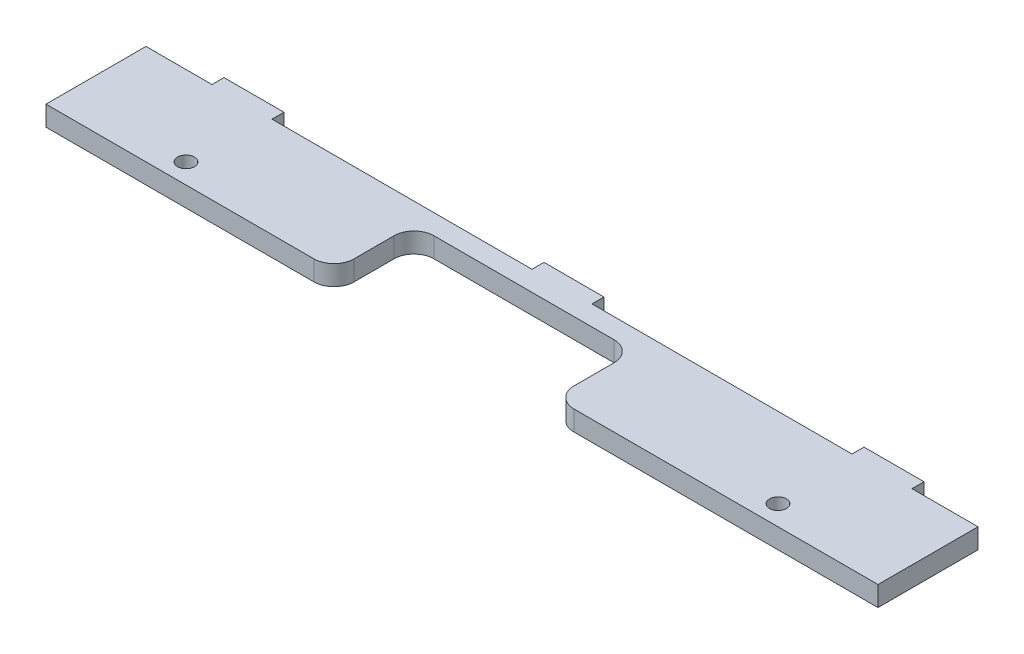
ISO-10303-21;
HEADER;
FILE_DESCRIPTION(('STEP AP214'),'2;1');
FILE_NAME('part.step','',(''),(''),'','','');
FILE_SCHEMA(('AUTOMOTIVE_DESIGN { 1 0 10303 214 1 1 1 1 }'));
ENDSEC;
DATA;
#1=APPLICATION_CONTEXT('core data for automotive mechanical design processes');
#2=APPLICATION_PROTOCOL_DEFINITION('international standard','automotive_design',2000,#1);
#3=PRODUCT_CONTEXT('',#1,'mechanical');
#4=PRODUCT('Part','Part','',(#3));
#5=PRODUCT_RELATED_PRODUCT_CATEGORY('part','',(#4));
#6=PRODUCT_DEFINITION_FORMATION('','',#4);
#7=PRODUCT_DEFINITION_CONTEXT('part definition',#1,'design');
#8=PRODUCT_DEFINITION('design','',#6,#7);
#9=PRODUCT_DEFINITION_SHAPE('','',#8);
#10=(LENGTH_UNIT() NAMED_UNIT(*) SI_UNIT(.MILLI.,.METRE.));
#11=(NAMED_UNIT(*) PLANE_ANGLE_UNIT() SI_UNIT($,.RADIAN.));
#12=(NAMED_UNIT(*) SI_UNIT($,.STERADIAN.) SOLID_ANGLE_UNIT());
#13=UNCERTAINTY_MEASURE_WITH_UNIT(LENGTH_MEASURE(1.E-05),#10,'distance_accuracy_value','');
#14=(GEOMETRIC_REPRESENTATION_CONTEXT(3) GLOBAL_UNCERTAINTY_ASSIGNED_CONTEXT((#13)) GLOBAL_UNIT_ASSIGNED_CONTEXT((#10,
#11,#12)) REPRESENTATION_CONTEXT('',''));
#15=CARTESIAN_POINT('',(0.,0.,0.));
#16=DIRECTION('',(0.,0.,1.));
#17=DIRECTION('',(1.,0.,0.));
#18=AXIS2_PLACEMENT_3D('',#15,#16,#17);
#19=CARTESIAN_POINT('',(-59.7452991513512,5.,-16.6679805469306));
#20=DIRECTION('',(0.,0.,1.));
#21=DIRECTION('',(1.,0.,0.));
#22=AXIS2_PLACEMENT_3D('',#19,#20,#21);
#23=PLANE('',#22);
#24=DIRECTION('',(-1.,0.,0.));
#25=VECTOR('',#24,1.);
#26=CARTESIAN_POINT('',(-59.7452991513512,0.,-16.6679805469306));
#27=LINE('',#26,#25);
#28=CARTESIAN_POINT('',(36.7547008486487,0.,-16.6679805469306));
#29=VERTEX_POINT('',#28);
#30=CARTESIAN_POINT('',(-28.2452991513512,0.,-16.6679805469306));
#31=VERTEX_POINT('',#30);
#32=EDGE_CURVE('E308',#29,#31,#27,.T.);
#33=ORIENTED_EDGE('',*,*,#32,.T.);
#34=DIRECTION('',(0.,-1.,0.));
#35=VECTOR('',#34,1.);
#36=CARTESIAN_POINT('',(-28.2452991513512,5.,-16.6679805469312));
#37=LINE('',#36,#35);
#38=CARTESIAN_POINT('',(-28.2452991513512,5.,-16.6679805469306));
#39=VERTEX_POINT('',#38);
#40=EDGE_CURVE('E60',#39,#31,#37,.T.);
#41=ORIENTED_EDGE('',*,*,#40,.F.);
#42=DIRECTION('',(-1.,0.,0.));
#43=VECTOR('',#42,1.);
#44=CARTESIAN_POINT('',(-59.7452991513512,5.,-16.6679805469306));
#45=LINE('',#44,#43);
#46=CARTESIAN_POINT('',(36.7547008486488,5.,-16.6679805469306));
#47=VERTEX_POINT('',#46);
#48=EDGE_CURVE('E340',#47,#39,#45,.T.);
#49=ORIENTED_EDGE('',*,*,#48,.F.);
#50=DIRECTION('',(0.,-1.,0.));
#51=VECTOR('',#50,1.);
#52=CARTESIAN_POINT('',(36.7547008486488,5.,-16.6679805469306));
#53=LINE('',#52,#51);
#54=EDGE_CURVE('E279',#47,#29,#53,.T.);
#55=ORIENTED_EDGE('',*,*,#54,.T.);
#56=EDGE_LOOP('',(#33,#41,#49,#55));
#57=FACE_BOUND('',#56,.T.);
#58=ADVANCED_FACE('F35',(#57),#23,.F.);
#59=CARTESIAN_POINT('',(148.254700848649,0.,-16.6679805469306));
#60=VERTEX_POINT('',#59);
#61=CARTESIAN_POINT('',(131.754700848649,0.,-16.6679805469306));
#62=VERTEX_POINT('',#61);
#63=EDGE_CURVE('E307',#60,#62,#27,.T.);
#64=ORIENTED_EDGE('',*,*,#63,.T.);
#65=DIRECTION('',(0.,-1.,0.));
#66=VECTOR('',#65,1.);
#67=CARTESIAN_POINT('',(131.754700848649,5.,-16.6679805469306));
#68=LINE('',#67,#66);
#69=CARTESIAN_POINT('',(131.754700848649,5.,-16.6679805469306));
#70=VERTEX_POINT('',#69);
#71=EDGE_CURVE('E246',#70,#62,#68,.T.);
#72=ORIENTED_EDGE('',*,*,#71,.F.);
#73=CARTESIAN_POINT('',(148.254700848649,5.,-16.6679805469306));
#74=VERTEX_POINT('',#73);
#75=EDGE_CURVE('E333',#74,#70,#45,.T.);
#76=ORIENTED_EDGE('',*,*,#75,.F.);
#77=DIRECTION('',(0.,-1.,0.));
#78=VECTOR('',#77,1.);
#79=CARTESIAN_POINT('',(148.254700848649,5.,-16.6679805469306));
#80=LINE('',#79,#78);
#81=EDGE_CURVE('E326',#74,#60,#80,.T.);
#82=ORIENTED_EDGE('',*,*,#81,.T.);
#83=EDGE_LOOP('',(#64,#72,#76,#82));
#84=FACE_BOUND('',#83,.T.);
#85=ADVANCED_FACE('F374',(#84),#23,.F.);
#86=CARTESIAN_POINT('',(116.754700848649,5.,-16.6679805469306));
#87=VERTEX_POINT('',#86);
#88=CARTESIAN_POINT('',(51.7547008486488,5.,-16.6679805469306));
#89=VERTEX_POINT('',#88);
#90=EDGE_CURVE('E309',#87,#89,#45,.T.);
#91=ORIENTED_EDGE('',*,*,#90,.F.);
#92=DIRECTION('',(0.,-1.,0.));
#93=VECTOR('',#92,1.);
#94=CARTESIAN_POINT('',(116.754700848649,5.,-16.6679805469306));
#95=LINE('',#94,#93);
#96=CARTESIAN_POINT('',(116.754700848649,0.,-16.6679805469306));
#97=VERTEX_POINT('',#96);
#98=EDGE_CURVE('E259',#87,#97,#95,.T.);
#99=ORIENTED_EDGE('',*,*,#98,.T.);
#100=CARTESIAN_POINT('',(51.7547008486488,0.,-16.6679805469306));
#101=VERTEX_POINT('',#100);
#102=EDGE_CURVE('E304',#97,#101,#27,.T.);
#103=ORIENTED_EDGE('',*,*,#102,.T.);
#104=DIRECTION('',(0.,-1.,0.));
#105=VECTOR('',#104,1.);
#106=CARTESIAN_POINT('',(51.7547008486488,5.,-16.6679805469306));
#107=LINE('',#106,#105);
#108=EDGE_CURVE('E267',#89,#101,#107,.T.);
#109=ORIENTED_EDGE('',*,*,#108,.F.);
#110=EDGE_LOOP('',(#91,#99,#103,#109));
#111=FACE_BOUND('',#110,.T.);
#112=ADVANCED_FACE('F393',(#111),#23,.F.);
#113=CARTESIAN_POINT('',(-59.7452991513512,5.,8.3320194530694));
#114=DIRECTION('',(0.,0.,-1.));
#115=DIRECTION('',(-1.,0.,0.));
#116=AXIS2_PLACEMENT_3D('',#113,#114,#115);
#117=PLANE('',#116);
#118=DIRECTION('',(0.,-1.,0.));
#119=VECTOR('',#118,1.);
#120=CARTESIAN_POINT('',(72.2547008486488,5.,8.3320194530694));
#121=LINE('',#120,#119);
#122=CARTESIAN_POINT('',(72.2547008486488,5.,8.3320194530694));
#123=VERTEX_POINT('',#122);
#124=CARTESIAN_POINT('',(72.2547008486488,0.,8.3320194530694));
#125=VERTEX_POINT('',#124);
#126=EDGE_CURVE('E365',#123,#125,#121,.T.);
#127=ORIENTED_EDGE('',*,*,#126,.T.);
#128=DIRECTION('',(1.,0.,0.));
#129=VECTOR('',#128,1.);
#130=CARTESIAN_POINT('',(-59.7452991513512,0.,8.3320194530694));
#131=LINE('',#130,#129);
#132=CARTESIAN_POINT('',(148.254700848649,0.,8.3320194530694));
#133=VERTEX_POINT('',#132);
#134=EDGE_CURVE('E351',#125,#133,#131,.T.);
#135=ORIENTED_EDGE('',*,*,#134,.T.);
#136=DIRECTION('',(0.,-1.,0.));
#137=VECTOR('',#136,1.);
#138=CARTESIAN_POINT('',(148.254700848649,5.,8.3320194530694));
#139=LINE('',#138,#137);
#140=CARTESIAN_POINT('',(148.254700848649,5.,8.3320194530694));
#141=VERTEX_POINT('',#140);
#142=EDGE_CURVE('E45',#141,#133,#139,.T.);
#143=ORIENTED_EDGE('',*,*,#142,.F.);
#144=DIRECTION('',(1.,0.,0.));
#145=VECTOR('',#144,1.);
#146=CARTESIAN_POINT('',(-59.7452991513512,5.,8.3320194530694));
#147=LINE('',#146,#145);
#148=EDGE_CURVE('E404',#123,#141,#147,.T.);
#149=ORIENTED_EDGE('',*,*,#148,.F.);
#150=EDGE_LOOP('',(#127,#135,#143,#149));
#151=FACE_BOUND('',#150,.T.);
#152=ADVANCED_FACE('F362',(#151),#117,.F.);
#153=CARTESIAN_POINT('',(-59.7452991513512,5.,-16.6679805469306));
#154=DIRECTION('',(1.,0.,0.));
#155=DIRECTION('',(0.,0.,-1.));
#156=AXIS2_PLACEMENT_3D('',#153,#154,#155);
#157=PLANE('',#156);
#158=DIRECTION('',(0.,0.,1.));
#159=VECTOR('',#158,1.);
#160=CARTESIAN_POINT('',(-59.7452991513512,0.,-16.6679805469306));
#161=LINE('',#160,#159);
#162=CARTESIAN_POINT('',(-59.7452991513512,0.,-16.6679805469306));
#163=VERTEX_POINT('',#162);
#164=CARTESIAN_POINT('',(-59.7452991513512,0.,8.3320194530694));
#165=VERTEX_POINT('',#164);
#166=EDGE_CURVE('E347',#163,#165,#161,.T.);
#167=ORIENTED_EDGE('',*,*,#166,.T.);
#168=DIRECTION('',(0.,-1.,0.));
#169=VECTOR('',#168,1.);
#170=CARTESIAN_POINT('',(-59.7452991513512,5.,8.3320194530694));
#171=LINE('',#170,#169);
#172=CARTESIAN_POINT('',(-59.7452991513512,5.,8.3320194530694));
#173=VERTEX_POINT('',#172);
#174=EDGE_CURVE('E11',#173,#165,#171,.T.);
#175=ORIENTED_EDGE('',*,*,#174,.F.);
#176=DIRECTION('',(0.,0.,1.));
#177=VECTOR('',#176,1.);
#178=CARTESIAN_POINT('',(-59.7452991513512,5.,-16.6679805469306));
#179=LINE('',#178,#177);
#180=CARTESIAN_POINT('',(-59.7452991513512,5.,-16.6679805469306));
#181=VERTEX_POINT('',#180);
#182=EDGE_CURVE('E323',#181,#173,#179,.T.);
#183=ORIENTED_EDGE('',*,*,#182,.F.);
#184=DIRECTION('',(0.,-1.,0.));
#185=VECTOR('',#184,1.);
#186=CARTESIAN_POINT('',(-59.7452991513512,5.,-16.6679805469306));
#187=LINE('',#186,#185);
#188=EDGE_CURVE('E315',#181,#163,#187,.T.);
#189=ORIENTED_EDGE('',*,*,#188,.T.);
#190=EDGE_LOOP('',(#167,#175,#183,#189));
#191=FACE_BOUND('',#190,.T.);
#192=ADVANCED_FACE('F37',(#191),#157,.F.);
#193=CARTESIAN_POINT('',(7.25470084864875,0.,8.3320194530694));
#194=VERTEX_POINT('',#193);
#195=EDGE_CURVE('E353',#165,#194,#131,.T.);
#196=ORIENTED_EDGE('',*,*,#195,.T.);
#197=DIRECTION('',(0.,-1.,0.));
#198=VECTOR('',#197,1.);
#199=CARTESIAN_POINT('',(7.25470084864875,5.,8.3320194530694));
#200=LINE('',#199,#198);
#201=CARTESIAN_POINT('',(7.25470084864875,5.,8.3320194530694));
#202=VERTEX_POINT('',#201);
#203=EDGE_CURVE('E414',#202,#194,#200,.T.);
#204=ORIENTED_EDGE('',*,*,#203,.F.);
#205=EDGE_CURVE('E402',#173,#202,#147,.T.);
#206=ORIENTED_EDGE('',*,*,#205,.F.);
#207=ORIENTED_EDGE('',*,*,#174,.T.);
#208=EDGE_LOOP('',(#196,#204,#206,#207));
#209=FACE_BOUND('',#208,.T.);
#210=ADVANCED_FACE('F512',(#209),#117,.F.);
#211=CARTESIAN_POINT('',(148.254700848649,5.,-16.6679805469306));
#212=DIRECTION('',(-1.,0.,0.));
#213=DIRECTION('',(0.,0.,1.));
#214=AXIS2_PLACEMENT_3D('',#211,#212,#213);
#215=PLANE('',#214);
#216=DIRECTION('',(0.,0.,-1.));
#217=VECTOR('',#216,1.);
#218=CARTESIAN_POINT('',(148.254700848649,0.,-16.6679805469306));
#219=LINE('',#218,#217);
#220=EDGE_CURVE('E313',#133,#60,#219,.T.);
#221=ORIENTED_EDGE('',*,*,#220,.T.);
#222=ORIENTED_EDGE('',*,*,#81,.F.);
#223=DIRECTION('',(0.,0.,-1.));
#224=VECTOR('',#223,1.);
#225=CARTESIAN_POINT('',(148.254700848649,5.,-16.6679805469306));
#226=LINE('',#225,#224);
#227=EDGE_CURVE('E345',#141,#74,#226,.T.);
#228=ORIENTED_EDGE('',*,*,#227,.F.);
#229=ORIENTED_EDGE('',*,*,#142,.T.);
#230=EDGE_LOOP('',(#221,#222,#228,#229));
#231=FACE_BOUND('',#230,.T.);
#232=ADVANCED_FACE('F370',(#231),#215,.F.);
#233=CARTESIAN_POINT('',(-43.2452991513512,5.,-16.6679805469306));
#234=VERTEX_POINT('',#233);
#235=EDGE_CURVE('E39',#234,#181,#45,.T.);
#236=ORIENTED_EDGE('',*,*,#235,.F.);
#237=DIRECTION('',(0.,-1.,0.));
#238=VECTOR('',#237,1.);
#239=CARTESIAN_POINT('',(-43.2452991513512,5.,-16.6679805469312));
#240=LINE('',#239,#238);
#241=CARTESIAN_POINT('',(-43.2452991513512,0.,-16.6679805469312));
#242=VERTEX_POINT('',#241);
#243=EDGE_CURVE('E211',#234,#242,#240,.T.);
#244=ORIENTED_EDGE('',*,*,#243,.T.);
#245=EDGE_CURVE('E357',#242,#163,#27,.T.);
#246=ORIENTED_EDGE('',*,*,#245,.T.);
#247=ORIENTED_EDGE('',*,*,#188,.F.);
#248=EDGE_LOOP('',(#236,#244,#246,#247));
#249=FACE_BOUND('',#248,.T.);
#250=ADVANCED_FACE('F501',(#249),#23,.F.);
#251=CARTESIAN_POINT('',(0.,5.,0.));
#252=DIRECTION('',(0.,1.,0.));
#253=DIRECTION('',(0.,0.,1.));
#254=AXIS2_PLACEMENT_3D('',#251,#252,#253);
#255=PLANE('',#254);
#256=CARTESIAN_POINT('',(118.254700848649,5.,3.3320194530694));
#257=DIRECTION('',(0.,-1.,0.));
#258=DIRECTION('',(0.,0.,-1.));
#259=AXIS2_PLACEMENT_3D('',#256,#257,#258);
#260=CIRCLE('',#259,2.1);
#261=CARTESIAN_POINT('',(118.254700848649,5.,1.2320194530694));
#262=VERTEX_POINT('',#261);
#263=EDGE_CURVE('E465',#262,#262,#260,.T.);
#264=ORIENTED_EDGE('',*,*,#263,.T.);
#265=EDGE_LOOP('',(#264));
#266=FACE_BOUND('',#265,.T.);
#267=CARTESIAN_POINT('',(-29.7452991513512,5.,3.3320194530694));
#268=DIRECTION('',(0.,-1.,0.));
#269=DIRECTION('',(0.,0.,-1.));
#270=AXIS2_PLACEMENT_3D('',#267,#268,#269);
#271=CIRCLE('',#270,2.1);
#272=CARTESIAN_POINT('',(-29.7452991513512,5.,1.2320194530694));
#273=VERTEX_POINT('',#272);
#274=EDGE_CURVE('E443',#273,#273,#271,.T.);
#275=ORIENTED_EDGE('',*,*,#274,.T.);
#276=EDGE_LOOP('',(#275));
#277=FACE_BOUND('',#276,.T.);
#278=CARTESIAN_POINT('',(7.25470084864879,5.,3.3320194530694));
#279=DIRECTION('',(0.,1.,0.));
#280=DIRECTION('',(0.,0.,-1.));
#281=AXIS2_PLACEMENT_3D('',#278,#279,#280);
#282=CIRCLE('',#281,5.);
#283=CARTESIAN_POINT('',(12.2547008486488,5.,3.3320194530694));
#284=VERTEX_POINT('',#283);
#285=EDGE_CURVE('E452',#202,#284,#282,.T.);
#286=ORIENTED_EDGE('',*,*,#285,.T.);
#287=DIRECTION('',(0.,0.,-1.));
#288=VECTOR('',#287,1.);
#289=CARTESIAN_POINT('',(12.2547008486488,5.,3.3320194530694));
#290=LINE('',#289,#288);
#291=CARTESIAN_POINT('',(12.2547008486488,5.,-6.6679805469306));
#292=VERTEX_POINT('',#291);
#293=EDGE_CURVE('E449',#284,#292,#290,.T.);
#294=ORIENTED_EDGE('',*,*,#293,.T.);
#295=CARTESIAN_POINT('',(17.2547008486488,5.,-6.6679805469306));
#296=DIRECTION('',(0.,-1.,0.));
#297=DIRECTION('',(0.,0.,1.));
#298=AXIS2_PLACEMENT_3D('',#295,#296,#297);
#299=CIRCLE('',#298,5.);
#300=CARTESIAN_POINT('',(17.2547008486488,5.,-11.6679805469306));
#301=VERTEX_POINT('',#300);
#302=EDGE_CURVE('E446',#292,#301,#299,.T.);
#303=ORIENTED_EDGE('',*,*,#302,.T.);
#304=DIRECTION('',(1.,0.,0.));
#305=VECTOR('',#304,1.);
#306=CARTESIAN_POINT('',(62.2547008486488,5.,-11.6679805469306));
#307=LINE('',#306,#305);
#308=CARTESIAN_POINT('',(62.2547008486488,5.,-11.6679805469306));
#309=VERTEX_POINT('',#308);
#310=EDGE_CURVE('E411',#301,#309,#307,.T.);
#311=ORIENTED_EDGE('',*,*,#310,.T.);
#312=CARTESIAN_POINT('',(62.2547008486488,5.,-6.6679805469306));
#313=DIRECTION('',(0.,-1.,0.));
#314=DIRECTION('',(0.,0.,1.));
#315=AXIS2_PLACEMENT_3D('',#312,#313,#314);
#316=CIRCLE('',#315,5.);
#317=CARTESIAN_POINT('',(67.2547008486488,5.,-6.6679805469306));
#318=VERTEX_POINT('',#317);
#319=EDGE_CURVE('E426',#309,#318,#316,.T.);
#320=ORIENTED_EDGE('',*,*,#319,.T.);
#321=DIRECTION('',(0.,0.,1.));
#322=VECTOR('',#321,1.);
#323=CARTESIAN_POINT('',(67.2547008486488,5.,3.3320194530694));
#324=LINE('',#323,#322);
#325=CARTESIAN_POINT('',(67.2547008486488,5.,3.3320194530694));
#326=VERTEX_POINT('',#325);
#327=EDGE_CURVE('E457',#318,#326,#324,.T.);
#328=ORIENTED_EDGE('',*,*,#327,.T.);
#329=CARTESIAN_POINT('',(72.2547008486488,5.,3.3320194530694));
#330=DIRECTION('',(0.,1.,0.));
#331=DIRECTION('',(0.,0.,-1.));
#332=AXIS2_PLACEMENT_3D('',#329,#330,#331);
#333=CIRCLE('',#332,5.);
#334=EDGE_CURVE('E454',#326,#123,#333,.T.);
#335=ORIENTED_EDGE('',*,*,#334,.T.);
#336=ORIENTED_EDGE('',*,*,#148,.T.);
#337=ORIENTED_EDGE('',*,*,#227,.T.);
#338=ORIENTED_EDGE('',*,*,#75,.T.);
#339=DIRECTION('',(0.,0.,1.));
#340=VECTOR('',#339,1.);
#341=CARTESIAN_POINT('',(131.754700848649,5.,-16.6679805469306));
#342=LINE('',#341,#340);
#343=CARTESIAN_POINT('',(131.754700848649,5.,-19.6679805469306));
#344=VERTEX_POINT('',#343);
#345=EDGE_CURVE('E236',#344,#70,#342,.T.);
#346=ORIENTED_EDGE('',*,*,#345,.F.);
#347=DIRECTION('',(1.,0.,0.));
#348=VECTOR('',#347,1.);
#349=CARTESIAN_POINT('',(116.754700848649,5.,-19.6679805469306));
#350=LINE('',#349,#348);
#351=CARTESIAN_POINT('',(116.754700848649,5.,-19.6679805469306));
#352=VERTEX_POINT('',#351);
#353=EDGE_CURVE('E243',#352,#344,#350,.T.);
#354=ORIENTED_EDGE('',*,*,#353,.F.);
#355=DIRECTION('',(0.,0.,-1.));
#356=VECTOR('',#355,1.);
#357=CARTESIAN_POINT('',(116.754700848649,5.,-16.6679805469306));
#358=LINE('',#357,#356);
#359=EDGE_CURVE('E239',#87,#352,#358,.T.);
#360=ORIENTED_EDGE('',*,*,#359,.F.);
#361=ORIENTED_EDGE('',*,*,#90,.T.);
#362=DIRECTION('',(0.,0.,1.));
#363=VECTOR('',#362,1.);
#364=CARTESIAN_POINT('',(51.7547008486488,5.,-16.6679805469306));
#365=LINE('',#364,#363);
#366=CARTESIAN_POINT('',(51.7547008486488,5.,-19.6679805469306));
#367=VERTEX_POINT('',#366);
#368=EDGE_CURVE('E272',#367,#89,#365,.T.);
#369=ORIENTED_EDGE('',*,*,#368,.F.);
#370=DIRECTION('',(1.,0.,0.));
#371=VECTOR('',#370,1.);
#372=CARTESIAN_POINT('',(36.7547008486488,5.,-19.6679805469306));
#373=LINE('',#372,#371);
#374=CARTESIAN_POINT('',(36.7547008486488,5.,-19.6679805469306));
#375=VERTEX_POINT('',#374);
#376=EDGE_CURVE('E264',#375,#367,#373,.T.);
#377=ORIENTED_EDGE('',*,*,#376,.F.);
#378=DIRECTION('',(0.,0.,-1.));
#379=VECTOR('',#378,1.);
#380=CARTESIAN_POINT('',(36.7547008486488,5.,-16.6679805469306));
#381=LINE('',#380,#379);
#382=EDGE_CURVE('E268',#47,#375,#381,.T.);
#383=ORIENTED_EDGE('',*,*,#382,.F.);
#384=ORIENTED_EDGE('',*,*,#48,.T.);
#385=DIRECTION('',(0.,0.,1.));
#386=VECTOR('',#385,1.);
#387=CARTESIAN_POINT('',(-28.2452991513512,5.,-16.6679805469312));
#388=LINE('',#387,#386);
#389=CARTESIAN_POINT('',(-28.2452991513512,5.,-19.6679805469312));
#390=VERTEX_POINT('',#389);
#391=EDGE_CURVE('E217',#390,#39,#388,.T.);
#392=ORIENTED_EDGE('',*,*,#391,.F.);
#393=DIRECTION('',(1.,0.,0.));
#394=VECTOR('',#393,1.);
#395=CARTESIAN_POINT('',(-43.2452991513512,5.,-19.6679805469312));
#396=LINE('',#395,#394);
#397=CARTESIAN_POINT('',(-43.2452991513512,5.,-19.6679805469312));
#398=VERTEX_POINT('',#397);
#399=EDGE_CURVE('E204',#398,#390,#396,.T.);
#400=ORIENTED_EDGE('',*,*,#399,.F.);
#401=DIRECTION('',(0.,0.,-1.));
#402=VECTOR('',#401,1.);
#403=CARTESIAN_POINT('',(-43.2452991513512,5.,-16.6679805469312));
#404=LINE('',#403,#402);
#405=EDGE_CURVE('E214',#234,#398,#404,.T.);
#406=ORIENTED_EDGE('',*,*,#405,.F.);
#407=ORIENTED_EDGE('',*,*,#235,.T.);
#408=ORIENTED_EDGE('',*,*,#182,.T.);
#409=ORIENTED_EDGE('',*,*,#205,.T.);
#410=EDGE_LOOP('',(#286,#294,#303,#311,#320,#328,#335,#336,#337,#338,#346,#354,#360,#361,#369,
#377,#383,#384,#392,#400,#406,#407,#408,#409));
#411=FACE_BOUND('',#410,.T.);
#412=ADVANCED_FACE('F221',(#266,#277,#411),#255,.T.);
#413=CARTESIAN_POINT('',(0.,0.,0.));
#414=DIRECTION('',(0.,1.,0.));
#415=DIRECTION('',(0.,0.,1.));
#416=AXIS2_PLACEMENT_3D('',#413,#414,#415);
#417=PLANE('',#416);
#418=CARTESIAN_POINT('',(118.254700848649,0.,3.3320194530694));
#419=DIRECTION('',(0.,-1.,0.));
#420=DIRECTION('',(0.,0.,-1.));
#421=AXIS2_PLACEMENT_3D('',#418,#419,#420);
#422=CIRCLE('',#421,2.1);
#423=CARTESIAN_POINT('',(118.254700848649,0.,1.2320194530694));
#424=VERTEX_POINT('',#423);
#425=EDGE_CURVE('E276',#424,#424,#422,.T.);
#426=ORIENTED_EDGE('',*,*,#425,.F.);
#427=EDGE_LOOP('',(#426));
#428=FACE_BOUND('',#427,.T.);
#429=CARTESIAN_POINT('',(-29.7452991513512,0.,3.3320194530694));
#430=DIRECTION('',(0.,-1.,0.));
#431=DIRECTION('',(0.,0.,-1.));
#432=AXIS2_PLACEMENT_3D('',#429,#430,#431);
#433=CIRCLE('',#432,2.1);
#434=CARTESIAN_POINT('',(-29.7452991513512,0.,1.2320194530694));
#435=VERTEX_POINT('',#434);
#436=EDGE_CURVE('E462',#435,#435,#433,.T.);
#437=ORIENTED_EDGE('',*,*,#436,.F.);
#438=EDGE_LOOP('',(#437));
#439=FACE_BOUND('',#438,.T.);
#440=DIRECTION('',(0.,0.,-1.));
#441=VECTOR('',#440,1.);
#442=CARTESIAN_POINT('',(12.2547008486488,0.,3.3320194530694));
#443=LINE('',#442,#441);
#444=CARTESIAN_POINT('',(12.2547008486488,0.,3.3320194530694));
#445=VERTEX_POINT('',#444);
#446=CARTESIAN_POINT('',(12.2547008486488,0.,-6.6679805469306));
#447=VERTEX_POINT('',#446);
#448=EDGE_CURVE('E430',#445,#447,#443,.T.);
#449=ORIENTED_EDGE('',*,*,#448,.F.);
#450=CARTESIAN_POINT('',(7.25470084864879,0.,3.3320194530694));
#451=DIRECTION('',(0.,1.,0.));
#452=DIRECTION('',(0.,0.,-1.));
#453=AXIS2_PLACEMENT_3D('',#450,#451,#452);
#454=CIRCLE('',#453,5.);
#455=EDGE_CURVE('E433',#194,#445,#454,.T.);
#456=ORIENTED_EDGE('',*,*,#455,.F.);
#457=ORIENTED_EDGE('',*,*,#195,.F.);
#458=ORIENTED_EDGE('',*,*,#166,.F.);
#459=ORIENTED_EDGE('',*,*,#245,.F.);
#460=DIRECTION('',(0.,0.,-1.));
#461=VECTOR('',#460,1.);
#462=CARTESIAN_POINT('',(-43.2452991513512,0.,-16.6679805469312));
#463=LINE('',#462,#461);
#464=CARTESIAN_POINT('',(-43.2452991513512,0.,-19.6679805469312));
#465=VERTEX_POINT('',#464);
#466=EDGE_CURVE('E230',#242,#465,#463,.T.);
#467=ORIENTED_EDGE('',*,*,#466,.T.);
#468=DIRECTION('',(1.,0.,0.));
#469=VECTOR('',#468,1.);
#470=CARTESIAN_POINT('',(-43.2452991513512,0.,-19.6679805469312));
#471=LINE('',#470,#469);
#472=CARTESIAN_POINT('',(-28.2452991513512,0.,-19.6679805469312));
#473=VERTEX_POINT('',#472);
#474=EDGE_CURVE('E206',#465,#473,#471,.T.);
#475=ORIENTED_EDGE('',*,*,#474,.T.);
#476=DIRECTION('',(0.,0.,1.));
#477=VECTOR('',#476,1.);
#478=CARTESIAN_POINT('',(-28.2452991513512,0.,-16.6679805469312));
#479=LINE('',#478,#477);
#480=EDGE_CURVE('E227',#473,#31,#479,.T.);
#481=ORIENTED_EDGE('',*,*,#480,.T.);
#482=ORIENTED_EDGE('',*,*,#32,.F.);
#483=DIRECTION('',(0.,0.,-1.));
#484=VECTOR('',#483,1.);
#485=CARTESIAN_POINT('',(36.7547008486488,0.,-16.6679805469306));
#486=LINE('',#485,#484);
#487=CARTESIAN_POINT('',(36.7547008486488,0.,-19.6679805469306));
#488=VERTEX_POINT('',#487);
#489=EDGE_CURVE('E273',#29,#488,#486,.T.);
#490=ORIENTED_EDGE('',*,*,#489,.T.);
#491=DIRECTION('',(1.,0.,0.));
#492=VECTOR('',#491,1.);
#493=CARTESIAN_POINT('',(36.7547008486488,0.,-19.6679805469306));
#494=LINE('',#493,#492);
#495=CARTESIAN_POINT('',(51.7547008486488,0.,-19.6679805469306));
#496=VERTEX_POINT('',#495);
#497=EDGE_CURVE('E269',#488,#496,#494,.T.);
#498=ORIENTED_EDGE('',*,*,#497,.T.);
#499=DIRECTION('',(0.,0.,1.));
#500=VECTOR('',#499,1.);
#501=CARTESIAN_POINT('',(51.7547008486488,0.,-16.6679805469306));
#502=LINE('',#501,#500);
#503=EDGE_CURVE('E256',#496,#101,#502,.T.);
#504=ORIENTED_EDGE('',*,*,#503,.T.);
#505=ORIENTED_EDGE('',*,*,#102,.F.);
#506=DIRECTION('',(0.,0.,-1.));
#507=VECTOR('',#506,1.);
#508=CARTESIAN_POINT('',(116.754700848649,0.,-16.6679805469306));
#509=LINE('',#508,#507);
#510=CARTESIAN_POINT('',(116.754700848649,0.,-19.6679805469306));
#511=VERTEX_POINT('',#510);
#512=EDGE_CURVE('E249',#97,#511,#509,.T.);
#513=ORIENTED_EDGE('',*,*,#512,.T.);
#514=DIRECTION('',(1.,0.,0.));
#515=VECTOR('',#514,1.);
#516=CARTESIAN_POINT('',(116.754700848649,0.,-19.6679805469306));
#517=LINE('',#516,#515);
#518=CARTESIAN_POINT('',(131.754700848649,0.,-19.6679805469306));
#519=VERTEX_POINT('',#518);
#520=EDGE_CURVE('E240',#511,#519,#517,.T.);
#521=ORIENTED_EDGE('',*,*,#520,.T.);
#522=DIRECTION('',(0.,0.,1.));
#523=VECTOR('',#522,1.);
#524=CARTESIAN_POINT('',(131.754700848649,0.,-16.6679805469306));
#525=LINE('',#524,#523);
#526=EDGE_CURVE('E233',#519,#62,#525,.T.);
#527=ORIENTED_EDGE('',*,*,#526,.T.);
#528=ORIENTED_EDGE('',*,*,#63,.F.);
#529=ORIENTED_EDGE('',*,*,#220,.F.);
#530=ORIENTED_EDGE('',*,*,#134,.F.);
#531=CARTESIAN_POINT('',(72.2547008486488,0.,3.3320194530694));
#532=DIRECTION('',(0.,1.,0.));
#533=DIRECTION('',(0.,0.,-1.));
#534=AXIS2_PLACEMENT_3D('',#531,#532,#533);
#535=CIRCLE('',#534,5.);
#536=CARTESIAN_POINT('',(67.2547008486488,0.,3.3320194530694));
#537=VERTEX_POINT('',#536);
#538=EDGE_CURVE('E436',#537,#125,#535,.T.);
#539=ORIENTED_EDGE('',*,*,#538,.F.);
#540=DIRECTION('',(0.,0.,1.));
#541=VECTOR('',#540,1.);
#542=CARTESIAN_POINT('',(67.2547008486488,0.,3.3320194530694));
#543=LINE('',#542,#541);
#544=CARTESIAN_POINT('',(67.2547008486488,0.,-6.6679805469306));
#545=VERTEX_POINT('',#544);
#546=EDGE_CURVE('E438',#545,#537,#543,.T.);
#547=ORIENTED_EDGE('',*,*,#546,.F.);
#548=CARTESIAN_POINT('',(62.2547008486488,0.,-6.6679805469306));
#549=DIRECTION('',(0.,-1.,0.));
#550=DIRECTION('',(0.,0.,1.));
#551=AXIS2_PLACEMENT_3D('',#548,#549,#550);
#552=CIRCLE('',#551,5.);
#553=CARTESIAN_POINT('',(62.2547008486488,0.,-11.6679805469306));
#554=VERTEX_POINT('',#553);
#555=EDGE_CURVE('E441',#554,#545,#552,.T.);
#556=ORIENTED_EDGE('',*,*,#555,.F.);
#557=DIRECTION('',(1.,0.,0.));
#558=VECTOR('',#557,1.);
#559=CARTESIAN_POINT('',(62.2547008486488,0.,-11.6679805469306));
#560=LINE('',#559,#558);
#561=CARTESIAN_POINT('',(17.2547008486488,0.,-11.6679805469306));
#562=VERTEX_POINT('',#561);
#563=EDGE_CURVE('E423',#562,#554,#560,.T.);
#564=ORIENTED_EDGE('',*,*,#563,.F.);
#565=CARTESIAN_POINT('',(17.2547008486488,0.,-6.6679805469306));
#566=DIRECTION('',(0.,-1.,0.));
#567=DIRECTION('',(0.,0.,1.));
#568=AXIS2_PLACEMENT_3D('',#565,#566,#567);
#569=CIRCLE('',#568,5.);
#570=EDGE_CURVE('E427',#447,#562,#569,.T.);
#571=ORIENTED_EDGE('',*,*,#570,.F.);
#572=EDGE_LOOP('',(#449,#456,#457,#458,#459,#467,#475,#481,#482,#490,#498,#504,#505,#513,#521,
#527,#528,#529,#530,#539,#547,#556,#564,#571));
#573=FACE_BOUND('',#572,.T.);
#574=ADVANCED_FACE('F372',(#428,#439,#573),#417,.F.);
#575=CARTESIAN_POINT('',(62.2547008486488,5.,-6.6679805469306));
#576=DIRECTION('',(0.,-1.,0.));
#577=DIRECTION('',(0.,0.,-1.));
#578=AXIS2_PLACEMENT_3D('',#575,#576,#577);
#579=CYLINDRICAL_SURFACE('',#578,5.);
#580=ORIENTED_EDGE('',*,*,#555,.T.);
#581=DIRECTION('',(0.,-1.,0.));
#582=VECTOR('',#581,1.);
#583=CARTESIAN_POINT('',(67.2547008486488,5.,-6.6679805469306));
#584=LINE('',#583,#582);
#585=EDGE_CURVE('E407',#318,#545,#584,.T.);
#586=ORIENTED_EDGE('',*,*,#585,.F.);
#587=ORIENTED_EDGE('',*,*,#319,.F.);
#588=DIRECTION('',(0.,-1.,0.));
#589=VECTOR('',#588,1.);
#590=CARTESIAN_POINT('',(62.2547008486488,5.,-11.6679805469306));
#591=LINE('',#590,#589);
#592=EDGE_CURVE('E352',#309,#554,#591,.T.);
#593=ORIENTED_EDGE('',*,*,#592,.T.);
#594=EDGE_LOOP('',(#580,#586,#587,#593));
#595=FACE_BOUND('',#594,.T.);
#596=ADVANCED_FACE('F483',(#595),#579,.F.);
#597=CARTESIAN_POINT('',(62.2547008486488,5.,-11.6679805469306));
#598=DIRECTION('',(0.,0.,-1.));
#599=DIRECTION('',(-1.,0.,0.));
#600=AXIS2_PLACEMENT_3D('',#597,#598,#599);
#601=PLANE('',#600);
#602=ORIENTED_EDGE('',*,*,#563,.T.);
#603=ORIENTED_EDGE('',*,*,#592,.F.);
#604=ORIENTED_EDGE('',*,*,#310,.F.);
#605=DIRECTION('',(0.,-1.,0.));
#606=VECTOR('',#605,1.);
#607=CARTESIAN_POINT('',(17.2547008486488,5.,-11.6679805469306));
#608=LINE('',#607,#606);
#609=EDGE_CURVE('E420',#301,#562,#608,.T.);
#610=ORIENTED_EDGE('',*,*,#609,.T.);
#611=EDGE_LOOP('',(#602,#603,#604,#610));
#612=FACE_BOUND('',#611,.T.);
#613=ADVANCED_FACE('F551',(#612),#601,.F.);
#614=CARTESIAN_POINT('',(17.2547008486488,5.,-6.6679805469306));
#615=DIRECTION('',(0.,-1.,0.));
#616=DIRECTION('',(0.,0.,-1.));
#617=AXIS2_PLACEMENT_3D('',#614,#615,#616);
#618=CYLINDRICAL_SURFACE('',#617,5.);
#619=ORIENTED_EDGE('',*,*,#570,.T.);
#620=ORIENTED_EDGE('',*,*,#609,.F.);
#621=ORIENTED_EDGE('',*,*,#302,.F.);
#622=DIRECTION('',(0.,-1.,0.));
#623=VECTOR('',#622,1.);
#624=CARTESIAN_POINT('',(12.2547008486488,5.,-6.6679805469306));
#625=LINE('',#624,#623);
#626=EDGE_CURVE('E418',#292,#447,#625,.T.);
#627=ORIENTED_EDGE('',*,*,#626,.T.);
#628=EDGE_LOOP('',(#619,#620,#621,#627));
#629=FACE_BOUND('',#628,.T.);
#630=ADVANCED_FACE('F560',(#629),#618,.F.);
#631=CARTESIAN_POINT('',(12.2547008486488,5.,3.3320194530694));
#632=DIRECTION('',(-1.,0.,0.));
#633=DIRECTION('',(0.,0.,1.));
#634=AXIS2_PLACEMENT_3D('',#631,#632,#633);
#635=PLANE('',#634);
#636=ORIENTED_EDGE('',*,*,#448,.T.);
#637=ORIENTED_EDGE('',*,*,#626,.F.);
#638=ORIENTED_EDGE('',*,*,#293,.F.);
#639=DIRECTION('',(0.,-1.,0.));
#640=VECTOR('',#639,1.);
#641=CARTESIAN_POINT('',(12.2547008486488,5.,3.3320194530694));
#642=LINE('',#641,#640);
#643=EDGE_CURVE('E416',#284,#445,#642,.T.);
#644=ORIENTED_EDGE('',*,*,#643,.T.);
#645=EDGE_LOOP('',(#636,#637,#638,#644));
#646=FACE_BOUND('',#645,.T.);
#647=ADVANCED_FACE('F568',(#646),#635,.F.);
#648=CARTESIAN_POINT('',(7.25470084864879,5.,3.3320194530694));
#649=DIRECTION('',(0.,-1.,0.));
#650=DIRECTION('',(0.,0.,-1.));
#651=AXIS2_PLACEMENT_3D('',#648,#649,#650);
#652=CYLINDRICAL_SURFACE('',#651,5.);
#653=ORIENTED_EDGE('',*,*,#455,.T.);
#654=ORIENTED_EDGE('',*,*,#643,.F.);
#655=ORIENTED_EDGE('',*,*,#285,.F.);
#656=ORIENTED_EDGE('',*,*,#203,.T.);
#657=EDGE_LOOP('',(#653,#654,#655,#656));
#658=FACE_BOUND('',#657,.T.);
#659=ADVANCED_FACE('F577',(#658),#652,.T.);
#660=CARTESIAN_POINT('',(72.2547008486488,5.,3.3320194530694));
#661=DIRECTION('',(0.,-1.,0.));
#662=DIRECTION('',(0.,0.,-1.));
#663=AXIS2_PLACEMENT_3D('',#660,#661,#662);
#664=CYLINDRICAL_SURFACE('',#663,5.);
#665=ORIENTED_EDGE('',*,*,#538,.T.);
#666=ORIENTED_EDGE('',*,*,#126,.F.);
#667=ORIENTED_EDGE('',*,*,#334,.F.);
#668=DIRECTION('',(0.,-1.,0.));
#669=VECTOR('',#668,1.);
#670=CARTESIAN_POINT('',(67.2547008486488,5.,3.3320194530694));
#671=LINE('',#670,#669);
#672=EDGE_CURVE('E410',#326,#537,#671,.T.);
#673=ORIENTED_EDGE('',*,*,#672,.T.);
#674=EDGE_LOOP('',(#665,#666,#667,#673));
#675=FACE_BOUND('',#674,.T.);
#676=ADVANCED_FACE('F494',(#675),#664,.T.);
#677=CARTESIAN_POINT('',(67.2547008486488,5.,3.3320194530694));
#678=DIRECTION('',(1.,0.,0.));
#679=DIRECTION('',(0.,0.,-1.));
#680=AXIS2_PLACEMENT_3D('',#677,#678,#679);
#681=PLANE('',#680);
#682=ORIENTED_EDGE('',*,*,#546,.T.);
#683=ORIENTED_EDGE('',*,*,#672,.F.);
#684=ORIENTED_EDGE('',*,*,#327,.F.);
#685=ORIENTED_EDGE('',*,*,#585,.T.);
#686=EDGE_LOOP('',(#682,#683,#684,#685));
#687=FACE_BOUND('',#686,.T.);
#688=ADVANCED_FACE('F488',(#687),#681,.F.);
#689=CARTESIAN_POINT('',(-29.7452991513512,5.,3.3320194530694));
#690=DIRECTION('',(0.,-1.,0.));
#691=DIRECTION('',(0.,0.,-1.));
#692=AXIS2_PLACEMENT_3D('',#689,#690,#691);
#693=CYLINDRICAL_SURFACE('',#692,2.1);
#694=ORIENTED_EDGE('',*,*,#274,.F.);
#695=EDGE_LOOP('',(#694));
#696=FACE_BOUND('',#695,.T.);
#697=ORIENTED_EDGE('',*,*,#436,.T.);
#698=EDGE_LOOP('',(#697));
#699=FACE_BOUND('',#698,.T.);
#700=ADVANCED_FACE('F477',(#696,#699),#693,.F.);
#701=CARTESIAN_POINT('',(118.254700848649,5.,3.3320194530694));
#702=DIRECTION('',(0.,-1.,0.));
#703=DIRECTION('',(0.,0.,-1.));
#704=AXIS2_PLACEMENT_3D('',#701,#702,#703);
#705=CYLINDRICAL_SURFACE('',#704,2.1);
#706=ORIENTED_EDGE('',*,*,#263,.F.);
#707=EDGE_LOOP('',(#706));
#708=FACE_BOUND('',#707,.T.);
#709=ORIENTED_EDGE('',*,*,#425,.T.);
#710=EDGE_LOOP('',(#709));
#711=FACE_BOUND('',#710,.T.);
#712=ADVANCED_FACE('F474',(#708,#711),#705,.F.);
#713=CARTESIAN_POINT('',(51.7547008486488,5.,-16.6679805469306));
#714=DIRECTION('',(1.,0.,0.));
#715=DIRECTION('',(0.,0.,-1.));
#716=AXIS2_PLACEMENT_3D('',#713,#714,#715);
#717=PLANE('',#716);
#718=ORIENTED_EDGE('',*,*,#503,.F.);
#719=DIRECTION('',(0.,-1.,0.));
#720=VECTOR('',#719,1.);
#721=CARTESIAN_POINT('',(51.7547008486488,5.,-19.6679805469306));
#722=LINE('',#721,#720);
#723=EDGE_CURVE('E274',#367,#496,#722,.T.);
#724=ORIENTED_EDGE('',*,*,#723,.F.);
#725=ORIENTED_EDGE('',*,*,#368,.T.);
#726=ORIENTED_EDGE('',*,*,#108,.T.);
#727=EDGE_LOOP('',(#718,#724,#725,#726));
#728=FACE_BOUND('',#727,.T.);
#729=ADVANCED_FACE('F392',(#728),#717,.T.);
#730=CARTESIAN_POINT('',(36.7547008486488,5.,-19.6679805469306));
#731=DIRECTION('',(0.,0.,-1.));
#732=DIRECTION('',(-1.,0.,0.));
#733=AXIS2_PLACEMENT_3D('',#730,#731,#732);
#734=PLANE('',#733);
#735=ORIENTED_EDGE('',*,*,#497,.F.);
#736=DIRECTION('',(0.,-1.,0.));
#737=VECTOR('',#736,1.);
#738=CARTESIAN_POINT('',(36.7547008486488,5.,-19.6679805469306));
#739=LINE('',#738,#737);
#740=EDGE_CURVE('E277',#375,#488,#739,.T.);
#741=ORIENTED_EDGE('',*,*,#740,.F.);
#742=ORIENTED_EDGE('',*,*,#376,.T.);
#743=ORIENTED_EDGE('',*,*,#723,.T.);
#744=EDGE_LOOP('',(#735,#741,#742,#743));
#745=FACE_BOUND('',#744,.T.);
#746=ADVANCED_FACE('F398',(#745),#734,.T.);
#747=CARTESIAN_POINT('',(36.7547008486488,5.,-16.6679805469306));
#748=DIRECTION('',(-1.,0.,0.));
#749=DIRECTION('',(0.,0.,1.));
#750=AXIS2_PLACEMENT_3D('',#747,#748,#749);
#751=PLANE('',#750);
#752=ORIENTED_EDGE('',*,*,#489,.F.);
#753=ORIENTED_EDGE('',*,*,#54,.F.);
#754=ORIENTED_EDGE('',*,*,#382,.T.);
#755=ORIENTED_EDGE('',*,*,#740,.T.);
#756=EDGE_LOOP('',(#752,#753,#754,#755));
#757=FACE_BOUND('',#756,.T.);
#758=ADVANCED_FACE('F659',(#757),#751,.T.);
#759=CARTESIAN_POINT('',(131.754700848649,5.,-16.6679805469306));
#760=DIRECTION('',(1.,0.,0.));
#761=DIRECTION('',(0.,0.,-1.));
#762=AXIS2_PLACEMENT_3D('',#759,#760,#761);
#763=PLANE('',#762);
#764=ORIENTED_EDGE('',*,*,#526,.F.);
#765=DIRECTION('',(0.,-1.,0.));
#766=VECTOR('',#765,1.);
#767=CARTESIAN_POINT('',(131.754700848649,5.,-19.6679805469306));
#768=LINE('',#767,#766);
#769=EDGE_CURVE('E254',#344,#519,#768,.T.);
#770=ORIENTED_EDGE('',*,*,#769,.F.);
#771=ORIENTED_EDGE('',*,*,#345,.T.);
#772=ORIENTED_EDGE('',*,*,#71,.T.);
#773=EDGE_LOOP('',(#764,#770,#771,#772));
#774=FACE_BOUND('',#773,.T.);
#775=ADVANCED_FACE('F376',(#774),#763,.T.);
#776=CARTESIAN_POINT('',(116.754700848649,5.,-19.6679805469306));
#777=DIRECTION('',(0.,0.,-1.));
#778=DIRECTION('',(-1.,0.,0.));
#779=AXIS2_PLACEMENT_3D('',#776,#777,#778);
#780=PLANE('',#779);
#781=ORIENTED_EDGE('',*,*,#520,.F.);
#782=DIRECTION('',(0.,-1.,0.));
#783=VECTOR('',#782,1.);
#784=CARTESIAN_POINT('',(116.754700848649,5.,-19.6679805469306));
#785=LINE('',#784,#783);
#786=EDGE_CURVE('E257',#352,#511,#785,.T.);
#787=ORIENTED_EDGE('',*,*,#786,.F.);
#788=ORIENTED_EDGE('',*,*,#353,.T.);
#789=ORIENTED_EDGE('',*,*,#769,.T.);
#790=EDGE_LOOP('',(#781,#787,#788,#789));
#791=FACE_BOUND('',#790,.T.);
#792=ADVANCED_FACE('F381',(#791),#780,.T.);
#793=CARTESIAN_POINT('',(116.754700848649,5.,-16.6679805469306));
#794=DIRECTION('',(-1.,0.,0.));
#795=DIRECTION('',(0.,0.,1.));
#796=AXIS2_PLACEMENT_3D('',#793,#794,#795);
#797=PLANE('',#796);
#798=ORIENTED_EDGE('',*,*,#512,.F.);
#799=ORIENTED_EDGE('',*,*,#98,.F.);
#800=ORIENTED_EDGE('',*,*,#359,.T.);
#801=ORIENTED_EDGE('',*,*,#786,.T.);
#802=EDGE_LOOP('',(#798,#799,#800,#801));
#803=FACE_BOUND('',#802,.T.);
#804=ADVANCED_FACE('F385',(#803),#797,.T.);
#805=CARTESIAN_POINT('',(-28.2452991513512,5.,-16.6679805469312));
#806=DIRECTION('',(1.,0.,0.));
#807=DIRECTION('',(0.,0.,-1.));
#808=AXIS2_PLACEMENT_3D('',#805,#806,#807);
#809=PLANE('',#808);
#810=ORIENTED_EDGE('',*,*,#480,.F.);
#811=DIRECTION('',(0.,-1.,0.));
#812=VECTOR('',#811,1.);
#813=CARTESIAN_POINT('',(-28.2452991513512,5.,-19.6679805469312));
#814=LINE('',#813,#812);
#815=EDGE_CURVE('E210',#390,#473,#814,.T.);
#816=ORIENTED_EDGE('',*,*,#815,.F.);
#817=ORIENTED_EDGE('',*,*,#391,.T.);
#818=ORIENTED_EDGE('',*,*,#40,.T.);
#819=EDGE_LOOP('',(#810,#816,#817,#818));
#820=FACE_BOUND('',#819,.T.);
#821=ADVANCED_FACE('F688',(#820),#809,.T.);
#822=CARTESIAN_POINT('',(-43.2452991513512,5.,-19.6679805469312));
#823=DIRECTION('',(0.,0.,-1.));
#824=DIRECTION('',(-1.,0.,0.));
#825=AXIS2_PLACEMENT_3D('',#822,#823,#824);
#826=PLANE('',#825);
#827=ORIENTED_EDGE('',*,*,#474,.F.);
#828=DIRECTION('',(0.,-1.,0.));
#829=VECTOR('',#828,1.);
#830=CARTESIAN_POINT('',(-43.2452991513512,5.,-19.6679805469312));
#831=LINE('',#830,#829);
#832=EDGE_CURVE('E200',#398,#465,#831,.T.);
#833=ORIENTED_EDGE('',*,*,#832,.F.);
#834=ORIENTED_EDGE('',*,*,#399,.T.);
#835=ORIENTED_EDGE('',*,*,#815,.T.);
#836=EDGE_LOOP('',(#827,#833,#834,#835));
#837=FACE_BOUND('',#836,.T.);
#838=ADVANCED_FACE('F202',(#837),#826,.T.);
#839=CARTESIAN_POINT('',(-43.2452991513512,5.,-16.6679805469312));
#840=DIRECTION('',(-1.,0.,0.));
#841=DIRECTION('',(0.,0.,1.));
#842=AXIS2_PLACEMENT_3D('',#839,#840,#841);
#843=PLANE('',#842);
#844=ORIENTED_EDGE('',*,*,#466,.F.);
#845=ORIENTED_EDGE('',*,*,#243,.F.);
#846=ORIENTED_EDGE('',*,*,#405,.T.);
#847=ORIENTED_EDGE('',*,*,#832,.T.);
#848=EDGE_LOOP('',(#844,#845,#846,#847));
#849=FACE_BOUND('',#848,.T.);
#850=ADVANCED_FACE('F215',(#849),#843,.T.);
#851=CLOSED_SHELL('',(#58,#85,#112,#152,#192,#210,#232,#250,#412,#574,#596,#613,#630,#647,#659,
#676,#688,#700,#712,#729,#746,#758,#775,#792,#804,#821,#838,#850));
#852=MANIFOLD_SOLID_BREP('B2',#851);
#853=ADVANCED_BREP_SHAPE_REPRESENTATION('',(#18,#852),#14);
#854=SHAPE_DEFINITION_REPRESENTATION(#9,#853);
ENDSEC;
END-ISO-10303-21;
